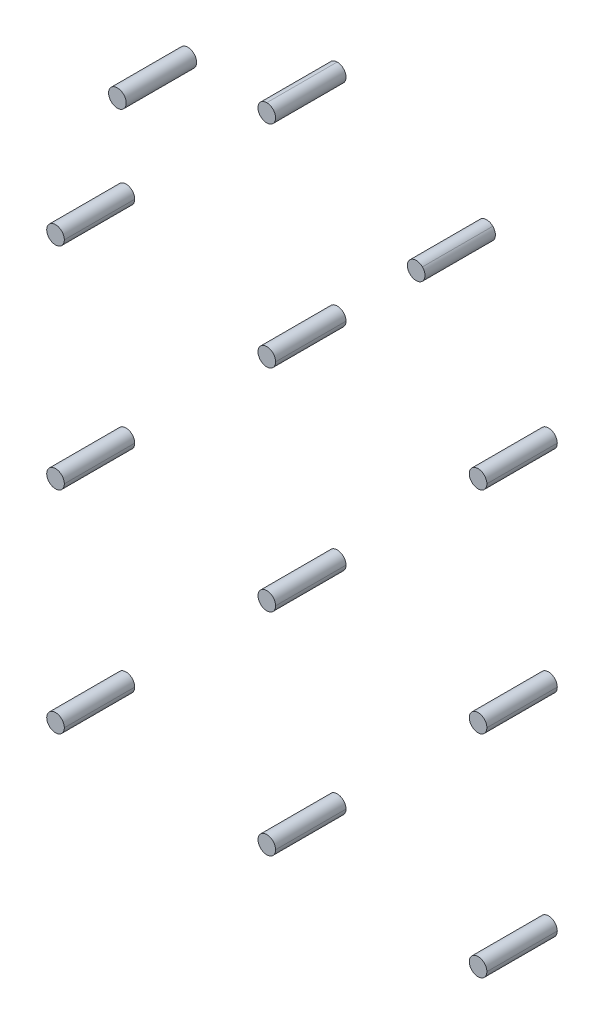
ISO-10303-21;
HEADER;
FILE_DESCRIPTION(('STEP AP214'),'2;1');
FILE_NAME('part.step','',(''),(''),'','','');
FILE_SCHEMA(('AUTOMOTIVE_DESIGN { 1 0 10303 214 1 1 1 1 }'));
ENDSEC;
DATA;
#1=APPLICATION_CONTEXT('core data for automotive mechanical design processes');
#2=APPLICATION_PROTOCOL_DEFINITION('international standard','automotive_design',2000,#1);
#3=PRODUCT_CONTEXT('',#1,'mechanical');
#4=PRODUCT('Part','Part','',(#3));
#5=PRODUCT_RELATED_PRODUCT_CATEGORY('part','',(#4));
#6=PRODUCT_DEFINITION_FORMATION('','',#4);
#7=PRODUCT_DEFINITION_CONTEXT('part definition',#1,'design');
#8=PRODUCT_DEFINITION('design','',#6,#7);
#9=PRODUCT_DEFINITION_SHAPE('','',#8);
#10=(LENGTH_UNIT() NAMED_UNIT(*) SI_UNIT(.MILLI.,.METRE.));
#11=(NAMED_UNIT(*) PLANE_ANGLE_UNIT() SI_UNIT($,.RADIAN.));
#12=(NAMED_UNIT(*) SI_UNIT($,.STERADIAN.) SOLID_ANGLE_UNIT());
#13=UNCERTAINTY_MEASURE_WITH_UNIT(LENGTH_MEASURE(1.E-05),#10,'distance_accuracy_value','');
#14=(GEOMETRIC_REPRESENTATION_CONTEXT(3) GLOBAL_UNCERTAINTY_ASSIGNED_CONTEXT((#13)) GLOBAL_UNIT_ASSIGNED_CONTEXT((#10,
#11,#12)) REPRESENTATION_CONTEXT('',''));
#15=CARTESIAN_POINT('',(0.,0.,0.));
#16=DIRECTION('',(0.,0.,1.));
#17=DIRECTION('',(1.,0.,0.));
#18=AXIS2_PLACEMENT_3D('',#15,#16,#17);
#19=CARTESIAN_POINT('',(0.,0.,1.));
#20=DIRECTION('',(0.,0.,1.));
#21=DIRECTION('',(1.,0.,0.));
#22=AXIS2_PLACEMENT_3D('',#19,#20,#21);
#23=PLANE('',#22);
#24=CARTESIAN_POINT('',(-6.,0.,1.));
#25=DIRECTION('',(0.,0.,1.));
#26=DIRECTION('',(1.,0.,0.));
#27=AXIS2_PLACEMENT_3D('',#24,#25,#26);
#28=CIRCLE('',#27,0.25);
#29=CARTESIAN_POINT('',(-6.25,0.,1.));
#30=VERTEX_POINT('',#29);
#31=CARTESIAN_POINT('',(-5.75,0.,1.));
#32=VERTEX_POINT('',#31);
#33=EDGE_CURVE('P0_E56',#30,#32,#28,.T.);
#34=ORIENTED_EDGE('',*,*,#33,.T.);
#35=CARTESIAN_POINT('',(-6.,0.,1.));
#36=DIRECTION('',(0.,0.,1.));
#37=DIRECTION('',(1.,0.,0.));
#38=AXIS2_PLACEMENT_3D('',#35,#36,#37);
#39=CIRCLE('',#38,0.25);
#40=EDGE_CURVE('P0_E11',#32,#30,#39,.T.);
#41=ORIENTED_EDGE('',*,*,#40,.T.);
#42=EDGE_LOOP('',(#34,#41));
#43=FACE_BOUND('',#42,.T.);
#44=ADVANCED_FACE('P0_F16',(#43),#23,.T.);
#45=CARTESIAN_POINT('',(0.,0.,-1.));
#46=DIRECTION('',(0.,0.,1.));
#47=DIRECTION('',(1.,0.,0.));
#48=AXIS2_PLACEMENT_3D('',#45,#46,#47);
#49=PLANE('',#48);
#50=CARTESIAN_POINT('',(-6.,0.,-1.));
#51=DIRECTION('',(0.,0.,1.));
#52=DIRECTION('',(1.,0.,0.));
#53=AXIS2_PLACEMENT_3D('',#50,#51,#52);
#54=CIRCLE('',#53,0.25);
#55=CARTESIAN_POINT('',(-5.75,0.,-1.));
#56=VERTEX_POINT('',#55);
#57=CARTESIAN_POINT('',(-6.25,0.,-1.));
#58=VERTEX_POINT('',#57);
#59=EDGE_CURVE('P0_E20',#56,#58,#54,.T.);
#60=ORIENTED_EDGE('',*,*,#59,.F.);
#61=CARTESIAN_POINT('',(-6.,0.,-1.));
#62=DIRECTION('',(0.,0.,1.));
#63=DIRECTION('',(1.,0.,0.));
#64=AXIS2_PLACEMENT_3D('',#61,#62,#63);
#65=CIRCLE('',#64,0.25);
#66=EDGE_CURVE('P0_E57',#58,#56,#65,.T.);
#67=ORIENTED_EDGE('',*,*,#66,.F.);
#68=EDGE_LOOP('',(#60,#67));
#69=FACE_BOUND('',#68,.T.);
#70=ADVANCED_FACE('P0_F18',(#69),#49,.F.);
#71=CARTESIAN_POINT('',(-6.,0.,0.));
#72=DIRECTION('',(0.,0.,1.));
#73=DIRECTION('',(-1.,0.,0.));
#74=AXIS2_PLACEMENT_3D('',#71,#72,#73);
#75=CYLINDRICAL_SURFACE('',#74,0.25);
#76=DIRECTION('',(0.,0.,1.));
#77=VECTOR('',#76,1.);
#78=CARTESIAN_POINT('',(-5.75,0.,0.));
#79=LINE('',#78,#77);
#80=EDGE_CURVE('P0_E52',#56,#32,#79,.T.);
#81=ORIENTED_EDGE('',*,*,#80,.F.);
#82=ORIENTED_EDGE('',*,*,#59,.T.);
#83=DIRECTION('',(0.,0.,1.));
#84=VECTOR('',#83,1.);
#85=CARTESIAN_POINT('',(-6.25,0.,0.));
#86=LINE('',#85,#84);
#87=EDGE_CURVE('P0_E50',#58,#30,#86,.T.);
#88=ORIENTED_EDGE('',*,*,#87,.T.);
#89=ORIENTED_EDGE('',*,*,#40,.F.);
#90=EDGE_LOOP('',(#81,#82,#88,#89));
#91=FACE_BOUND('',#90,.T.);
#92=ADVANCED_FACE('P0_F48',(#91),#75,.T.);
#93=CARTESIAN_POINT('',(-6.,0.,0.));
#94=DIRECTION('',(0.,0.,1.));
#95=DIRECTION('',(-1.,0.,0.));
#96=AXIS2_PLACEMENT_3D('',#93,#94,#95);
#97=CYLINDRICAL_SURFACE('',#96,0.25);
#98=ORIENTED_EDGE('',*,*,#87,.F.);
#99=ORIENTED_EDGE('',*,*,#66,.T.);
#100=ORIENTED_EDGE('',*,*,#80,.T.);
#101=ORIENTED_EDGE('',*,*,#33,.F.);
#102=EDGE_LOOP('',(#98,#99,#100,#101));
#103=FACE_BOUND('',#102,.T.);
#104=ADVANCED_FACE('P0_F62',(#103),#97,.T.);
#105=CLOSED_SHELL('',(#44,#70,#92,#104));
#106=MANIFOLD_SOLID_BREP('P0_B1',#105);
#107=CARTESIAN_POINT('',(0.,0.,1.));
#108=DIRECTION('',(0.,0.,1.));
#109=DIRECTION('',(1.,0.,0.));
#110=AXIS2_PLACEMENT_3D('',#107,#108,#109);
#111=PLANE('',#110);
#112=CARTESIAN_POINT('',(-6.,-6.,1.));
#113=DIRECTION('',(0.,0.,1.));
#114=DIRECTION('',(1.,0.,0.));
#115=AXIS2_PLACEMENT_3D('',#112,#113,#114);
#116=CIRCLE('',#115,0.25);
#117=CARTESIAN_POINT('',(-6.25,-6.,1.));
#118=VERTEX_POINT('',#117);
#119=CARTESIAN_POINT('',(-5.75,-6.,1.));
#120=VERTEX_POINT('',#119);
#121=EDGE_CURVE('P1_E59',#118,#120,#116,.T.);
#122=ORIENTED_EDGE('',*,*,#121,.T.);
#123=CARTESIAN_POINT('',(-6.,-6.,1.));
#124=DIRECTION('',(0.,0.,1.));
#125=DIRECTION('',(1.,0.,0.));
#126=AXIS2_PLACEMENT_3D('',#123,#124,#125);
#127=CIRCLE('',#126,0.25);
#128=EDGE_CURVE('P1_E11',#120,#118,#127,.T.);
#129=ORIENTED_EDGE('',*,*,#128,.T.);
#130=EDGE_LOOP('',(#122,#129));
#131=FACE_BOUND('',#130,.T.);
#132=ADVANCED_FACE('P1_F16',(#131),#111,.T.);
#133=CARTESIAN_POINT('',(0.,0.,-1.));
#134=DIRECTION('',(0.,0.,1.));
#135=DIRECTION('',(1.,0.,0.));
#136=AXIS2_PLACEMENT_3D('',#133,#134,#135);
#137=PLANE('',#136);
#138=CARTESIAN_POINT('',(-6.,-6.,-1.));
#139=DIRECTION('',(0.,0.,1.));
#140=DIRECTION('',(1.,0.,0.));
#141=AXIS2_PLACEMENT_3D('',#138,#139,#140);
#142=CIRCLE('',#141,0.25);
#143=CARTESIAN_POINT('',(-5.75,-6.,-1.));
#144=VERTEX_POINT('',#143);
#145=CARTESIAN_POINT('',(-6.25,-6.,-1.));
#146=VERTEX_POINT('',#145);
#147=EDGE_CURVE('P1_E26',#144,#146,#142,.T.);
#148=ORIENTED_EDGE('',*,*,#147,.F.);
#149=CARTESIAN_POINT('',(-6.,-6.,-1.));
#150=DIRECTION('',(0.,0.,1.));
#151=DIRECTION('',(1.,0.,0.));
#152=AXIS2_PLACEMENT_3D('',#149,#150,#151);
#153=CIRCLE('',#152,0.25);
#154=EDGE_CURVE('P1_E60',#146,#144,#153,.T.);
#155=ORIENTED_EDGE('',*,*,#154,.F.);
#156=EDGE_LOOP('',(#148,#155));
#157=FACE_BOUND('',#156,.T.);
#158=ADVANCED_FACE('P1_F61',(#157),#137,.F.);
#159=CARTESIAN_POINT('',(-6.,-6.,0.));
#160=DIRECTION('',(0.,0.,1.));
#161=DIRECTION('',(-1.,0.,0.));
#162=AXIS2_PLACEMENT_3D('',#159,#160,#161);
#163=CYLINDRICAL_SURFACE('',#162,0.25);
#164=DIRECTION('',(0.,0.,1.));
#165=VECTOR('',#164,1.);
#166=CARTESIAN_POINT('',(-5.75,-6.,0.));
#167=LINE('',#166,#165);
#168=EDGE_CURVE('P1_E55',#144,#120,#167,.T.);
#169=ORIENTED_EDGE('',*,*,#168,.F.);
#170=ORIENTED_EDGE('',*,*,#147,.T.);
#171=DIRECTION('',(0.,0.,1.));
#172=VECTOR('',#171,1.);
#173=CARTESIAN_POINT('',(-6.25,-6.,0.));
#174=LINE('',#173,#172);
#175=EDGE_CURVE('P1_E19',#146,#118,#174,.T.);
#176=ORIENTED_EDGE('',*,*,#175,.T.);
#177=ORIENTED_EDGE('',*,*,#128,.F.);
#178=EDGE_LOOP('',(#169,#170,#176,#177));
#179=FACE_BOUND('',#178,.T.);
#180=ADVANCED_FACE('P1_F52',(#179),#163,.T.);
#181=CARTESIAN_POINT('',(-6.,-6.,0.));
#182=DIRECTION('',(0.,0.,1.));
#183=DIRECTION('',(-1.,0.,0.));
#184=AXIS2_PLACEMENT_3D('',#181,#182,#183);
#185=CYLINDRICAL_SURFACE('',#184,0.25);
#186=ORIENTED_EDGE('',*,*,#175,.F.);
#187=ORIENTED_EDGE('',*,*,#154,.T.);
#188=ORIENTED_EDGE('',*,*,#168,.T.);
#189=ORIENTED_EDGE('',*,*,#121,.F.);
#190=EDGE_LOOP('',(#186,#187,#188,#189));
#191=FACE_BOUND('',#190,.T.);
#192=ADVANCED_FACE('P1_F65',(#191),#185,.T.);
#193=CLOSED_SHELL('',(#132,#158,#180,#192));
#194=MANIFOLD_SOLID_BREP('P1_B1',#193);
#195=CARTESIAN_POINT('',(0.,0.,1.));
#196=DIRECTION('',(0.,0.,1.));
#197=DIRECTION('',(1.,0.,0.));
#198=AXIS2_PLACEMENT_3D('',#195,#196,#197);
#199=PLANE('',#198);
#200=CARTESIAN_POINT('',(6.,-6.,1.));
#201=DIRECTION('',(0.,0.,1.));
#202=DIRECTION('',(1.,0.,0.));
#203=AXIS2_PLACEMENT_3D('',#200,#201,#202);
#204=CIRCLE('',#203,0.25);
#205=CARTESIAN_POINT('',(5.75,-6.,1.));
#206=VERTEX_POINT('',#205);
#207=CARTESIAN_POINT('',(6.25,-6.,1.));
#208=VERTEX_POINT('',#207);
#209=EDGE_CURVE('P2_E56',#206,#208,#204,.T.);
#210=ORIENTED_EDGE('',*,*,#209,.T.);
#211=CARTESIAN_POINT('',(6.,-6.,1.));
#212=DIRECTION('',(0.,0.,1.));
#213=DIRECTION('',(1.,0.,0.));
#214=AXIS2_PLACEMENT_3D('',#211,#212,#213);
#215=CIRCLE('',#214,0.25);
#216=EDGE_CURVE('P2_E11',#208,#206,#215,.T.);
#217=ORIENTED_EDGE('',*,*,#216,.T.);
#218=EDGE_LOOP('',(#210,#217));
#219=FACE_BOUND('',#218,.T.);
#220=ADVANCED_FACE('P2_F16',(#219),#199,.T.);
#221=CARTESIAN_POINT('',(0.,0.,-1.));
#222=DIRECTION('',(0.,0.,1.));
#223=DIRECTION('',(1.,0.,0.));
#224=AXIS2_PLACEMENT_3D('',#221,#222,#223);
#225=PLANE('',#224);
#226=CARTESIAN_POINT('',(6.,-6.,-1.));
#227=DIRECTION('',(0.,0.,1.));
#228=DIRECTION('',(1.,0.,0.));
#229=AXIS2_PLACEMENT_3D('',#226,#227,#228);
#230=CIRCLE('',#229,0.25);
#231=CARTESIAN_POINT('',(6.25,-6.,-1.));
#232=VERTEX_POINT('',#231);
#233=CARTESIAN_POINT('',(5.75,-6.,-1.));
#234=VERTEX_POINT('',#233);
#235=EDGE_CURVE('P2_E26',#232,#234,#230,.T.);
#236=ORIENTED_EDGE('',*,*,#235,.F.);
#237=CARTESIAN_POINT('',(6.,-6.,-1.));
#238=DIRECTION('',(0.,0.,1.));
#239=DIRECTION('',(1.,0.,0.));
#240=AXIS2_PLACEMENT_3D('',#237,#238,#239);
#241=CIRCLE('',#240,0.25);
#242=EDGE_CURVE('P2_E58',#234,#232,#241,.T.);
#243=ORIENTED_EDGE('',*,*,#242,.F.);
#244=EDGE_LOOP('',(#236,#243));
#245=FACE_BOUND('',#244,.T.);
#246=ADVANCED_FACE('P2_F59',(#245),#225,.F.);
#247=CARTESIAN_POINT('',(6.,-6.,0.));
#248=DIRECTION('',(0.,0.,1.));
#249=DIRECTION('',(-1.,0.,0.));
#250=AXIS2_PLACEMENT_3D('',#247,#248,#249);
#251=CYLINDRICAL_SURFACE('',#250,0.25);
#252=DIRECTION('',(0.,0.,1.));
#253=VECTOR('',#252,1.);
#254=CARTESIAN_POINT('',(6.25,-6.,0.));
#255=LINE('',#254,#253);
#256=EDGE_CURVE('P2_E20',#232,#208,#255,.T.);
#257=ORIENTED_EDGE('',*,*,#256,.F.);
#258=ORIENTED_EDGE('',*,*,#235,.T.);
#259=DIRECTION('',(0.,0.,1.));
#260=VECTOR('',#259,1.);
#261=CARTESIAN_POINT('',(5.75,-6.,0.));
#262=LINE('',#261,#260);
#263=EDGE_CURVE('P2_E52',#234,#206,#262,.T.);
#264=ORIENTED_EDGE('',*,*,#263,.T.);
#265=ORIENTED_EDGE('',*,*,#216,.F.);
#266=EDGE_LOOP('',(#257,#258,#264,#265));
#267=FACE_BOUND('',#266,.T.);
#268=ADVANCED_FACE('P2_F18',(#267),#251,.T.);
#269=CARTESIAN_POINT('',(6.,-6.,0.));
#270=DIRECTION('',(0.,0.,1.));
#271=DIRECTION('',(-1.,0.,0.));
#272=AXIS2_PLACEMENT_3D('',#269,#270,#271);
#273=CYLINDRICAL_SURFACE('',#272,0.25);
#274=ORIENTED_EDGE('',*,*,#263,.F.);
#275=ORIENTED_EDGE('',*,*,#242,.T.);
#276=ORIENTED_EDGE('',*,*,#256,.T.);
#277=ORIENTED_EDGE('',*,*,#209,.F.);
#278=EDGE_LOOP('',(#274,#275,#276,#277));
#279=FACE_BOUND('',#278,.T.);
#280=ADVANCED_FACE('P2_F64',(#279),#273,.T.);
#281=CLOSED_SHELL('',(#220,#246,#268,#280));
#282=MANIFOLD_SOLID_BREP('P2_B1',#281);
#283=CARTESIAN_POINT('',(0.,0.,1.));
#284=DIRECTION('',(0.,0.,1.));
#285=DIRECTION('',(1.,0.,0.));
#286=AXIS2_PLACEMENT_3D('',#283,#284,#285);
#287=PLANE('',#286);
#288=CARTESIAN_POINT('',(6.,-12.,1.));
#289=DIRECTION('',(0.,0.,1.));
#290=DIRECTION('',(1.,0.,0.));
#291=AXIS2_PLACEMENT_3D('',#288,#289,#290);
#292=CIRCLE('',#291,0.25);
#293=CARTESIAN_POINT('',(5.75,-12.,1.));
#294=VERTEX_POINT('',#293);
#295=CARTESIAN_POINT('',(6.25,-12.,1.));
#296=VERTEX_POINT('',#295);
#297=EDGE_CURVE('P3_E50',#294,#296,#292,.T.);
#298=ORIENTED_EDGE('',*,*,#297,.T.);
#299=CARTESIAN_POINT('',(6.,-12.,1.));
#300=DIRECTION('',(0.,0.,1.));
#301=DIRECTION('',(1.,0.,0.));
#302=AXIS2_PLACEMENT_3D('',#299,#300,#301);
#303=CIRCLE('',#302,0.25);
#304=EDGE_CURVE('P3_E11',#296,#294,#303,.T.);
#305=ORIENTED_EDGE('',*,*,#304,.T.);
#306=EDGE_LOOP('',(#298,#305));
#307=FACE_BOUND('',#306,.T.);
#308=ADVANCED_FACE('P3_F16',(#307),#287,.T.);
#309=CARTESIAN_POINT('',(0.,0.,-1.));
#310=DIRECTION('',(0.,0.,1.));
#311=DIRECTION('',(1.,0.,0.));
#312=AXIS2_PLACEMENT_3D('',#309,#310,#311);
#313=PLANE('',#312);
#314=CARTESIAN_POINT('',(6.,-12.,-1.));
#315=DIRECTION('',(0.,0.,1.));
#316=DIRECTION('',(1.,0.,0.));
#317=AXIS2_PLACEMENT_3D('',#314,#315,#316);
#318=CIRCLE('',#317,0.25);
#319=CARTESIAN_POINT('',(6.25,-12.,-1.));
#320=VERTEX_POINT('',#319);
#321=CARTESIAN_POINT('',(5.75,-12.,-1.));
#322=VERTEX_POINT('',#321);
#323=EDGE_CURVE('P3_E26',#320,#322,#318,.T.);
#324=ORIENTED_EDGE('',*,*,#323,.F.);
#325=CARTESIAN_POINT('',(6.,-12.,-1.));
#326=DIRECTION('',(0.,0.,1.));
#327=DIRECTION('',(1.,0.,0.));
#328=AXIS2_PLACEMENT_3D('',#325,#326,#327);
#329=CIRCLE('',#328,0.25);
#330=EDGE_CURVE('P3_E61',#322,#320,#329,.T.);
#331=ORIENTED_EDGE('',*,*,#330,.F.);
#332=EDGE_LOOP('',(#324,#331));
#333=FACE_BOUND('',#332,.T.);
#334=ADVANCED_FACE('P3_F107',(#333),#313,.F.);
#335=CARTESIAN_POINT('',(6.,-12.,0.));
#336=DIRECTION('',(0.,0.,1.));
#337=DIRECTION('',(-1.,0.,0.));
#338=AXIS2_PLACEMENT_3D('',#335,#336,#337);
#339=CYLINDRICAL_SURFACE('',#338,0.25);
#340=DIRECTION('',(0.,0.,1.));
#341=VECTOR('',#340,1.);
#342=CARTESIAN_POINT('',(6.25,-12.,0.));
#343=LINE('',#342,#341);
#344=EDGE_CURVE('P3_E57',#320,#296,#343,.T.);
#345=ORIENTED_EDGE('',*,*,#344,.F.);
#346=ORIENTED_EDGE('',*,*,#323,.T.);
#347=DIRECTION('',(0.,0.,1.));
#348=VECTOR('',#347,1.);
#349=CARTESIAN_POINT('',(5.75,-12.,0.));
#350=LINE('',#349,#348);
#351=EDGE_CURVE('P3_E56',#322,#294,#350,.T.);
#352=ORIENTED_EDGE('',*,*,#351,.T.);
#353=ORIENTED_EDGE('',*,*,#304,.F.);
#354=EDGE_LOOP('',(#345,#346,#352,#353));
#355=FACE_BOUND('',#354,.T.);
#356=ADVANCED_FACE('P3_F18',(#355),#339,.T.);
#357=CARTESIAN_POINT('',(6.,-12.,0.));
#358=DIRECTION('',(0.,0.,1.));
#359=DIRECTION('',(-1.,0.,0.));
#360=AXIS2_PLACEMENT_3D('',#357,#358,#359);
#361=CYLINDRICAL_SURFACE('',#360,0.25);
#362=ORIENTED_EDGE('',*,*,#351,.F.);
#363=ORIENTED_EDGE('',*,*,#330,.T.);
#364=ORIENTED_EDGE('',*,*,#344,.T.);
#365=ORIENTED_EDGE('',*,*,#297,.F.);
#366=EDGE_LOOP('',(#362,#363,#364,#365));
#367=FACE_BOUND('',#366,.T.);
#368=ADVANCED_FACE('P3_F54',(#367),#361,.T.);
#369=CLOSED_SHELL('',(#308,#334,#356,#368));
#370=MANIFOLD_SOLID_BREP('P3_B1',#369);
#371=CARTESIAN_POINT('',(0.,0.,1.));
#372=DIRECTION('',(0.,0.,1.));
#373=DIRECTION('',(1.,0.,0.));
#374=AXIS2_PLACEMENT_3D('',#371,#372,#373);
#375=PLANE('',#374);
#376=CARTESIAN_POINT('',(-4.24264068712,4.24264068712,1.));
#377=DIRECTION('',(0.,0.,1.));
#378=DIRECTION('',(1.,0.,0.));
#379=AXIS2_PLACEMENT_3D('',#376,#377,#378);
#380=CIRCLE('',#379,0.25);
#381=CARTESIAN_POINT('',(-4.41941738242,4.41941738242,1.));
#382=VERTEX_POINT('',#381);
#383=CARTESIAN_POINT('',(-4.06586399182,4.06586399182,1.));
#384=VERTEX_POINT('',#383);
#385=EDGE_CURVE('P4_E48',#382,#384,#380,.T.);
#386=ORIENTED_EDGE('',*,*,#385,.T.);
#387=CARTESIAN_POINT('',(-4.24264068712,4.24264068712,1.));
#388=DIRECTION('',(0.,0.,1.));
#389=DIRECTION('',(1.,0.,0.));
#390=AXIS2_PLACEMENT_3D('',#387,#388,#389);
#391=CIRCLE('',#390,0.25);
#392=EDGE_CURVE('P4_E11',#384,#382,#391,.T.);
#393=ORIENTED_EDGE('',*,*,#392,.T.);
#394=EDGE_LOOP('',(#386,#393));
#395=FACE_BOUND('',#394,.T.);
#396=ADVANCED_FACE('P4_F16',(#395),#375,.T.);
#397=CARTESIAN_POINT('',(0.,0.,-1.));
#398=DIRECTION('',(0.,0.,1.));
#399=DIRECTION('',(1.,0.,0.));
#400=AXIS2_PLACEMENT_3D('',#397,#398,#399);
#401=PLANE('',#400);
#402=CARTESIAN_POINT('',(-4.24264068712,4.24264068712,-1.));
#403=DIRECTION('',(0.,0.,1.));
#404=DIRECTION('',(1.,0.,0.));
#405=AXIS2_PLACEMENT_3D('',#402,#403,#404);
#406=CIRCLE('',#405,0.25);
#407=CARTESIAN_POINT('',(-4.06586399182,4.06586399182,-1.));
#408=VERTEX_POINT('',#407);
#409=CARTESIAN_POINT('',(-4.41941738242,4.41941738242,-1.));
#410=VERTEX_POINT('',#409);
#411=EDGE_CURVE('P4_E26',#408,#410,#406,.T.);
#412=ORIENTED_EDGE('',*,*,#411,.F.);
#413=CARTESIAN_POINT('',(-4.24264068712,4.24264068712,-1.));
#414=DIRECTION('',(0.,0.,1.));
#415=DIRECTION('',(1.,0.,0.));
#416=AXIS2_PLACEMENT_3D('',#413,#414,#415);
#417=CIRCLE('',#416,0.25);
#418=EDGE_CURVE('P4_E60',#410,#408,#417,.T.);
#419=ORIENTED_EDGE('',*,*,#418,.F.);
#420=EDGE_LOOP('',(#412,#419));
#421=FACE_BOUND('',#420,.T.);
#422=ADVANCED_FACE('P4_F104',(#421),#401,.F.);
#423=CARTESIAN_POINT('',(-4.24264068712,4.24264068712,0.));
#424=DIRECTION('',(0.,0.,1.));
#425=DIRECTION('',(-0.707106781186548,0.707106781186548,0.));
#426=AXIS2_PLACEMENT_3D('',#423,#424,#425);
#427=CYLINDRICAL_SURFACE('',#426,0.25);
#428=DIRECTION('',(0.,0.,1.));
#429=VECTOR('',#428,1.);
#430=CARTESIAN_POINT('',(-4.06586399182,4.06586399182,0.));
#431=LINE('',#430,#429);
#432=EDGE_CURVE('P4_E55',#408,#384,#431,.T.);
#433=ORIENTED_EDGE('',*,*,#432,.F.);
#434=ORIENTED_EDGE('',*,*,#411,.T.);
#435=DIRECTION('',(0.,0.,1.));
#436=VECTOR('',#435,1.);
#437=CARTESIAN_POINT('',(-4.41941738242,4.41941738242,0.));
#438=LINE('',#437,#436);
#439=EDGE_CURVE('P4_E54',#410,#382,#438,.T.);
#440=ORIENTED_EDGE('',*,*,#439,.T.);
#441=ORIENTED_EDGE('',*,*,#392,.F.);
#442=EDGE_LOOP('',(#433,#434,#440,#441));
#443=FACE_BOUND('',#442,.T.);
#444=ADVANCED_FACE('P4_F18',(#443),#427,.T.);
#445=CARTESIAN_POINT('',(-4.24264068712,4.24264068712,0.));
#446=DIRECTION('',(0.,0.,1.));
#447=DIRECTION('',(-0.707106781186548,0.707106781186548,0.));
#448=AXIS2_PLACEMENT_3D('',#445,#446,#447);
#449=CYLINDRICAL_SURFACE('',#448,0.25);
#450=ORIENTED_EDGE('',*,*,#439,.F.);
#451=ORIENTED_EDGE('',*,*,#418,.T.);
#452=ORIENTED_EDGE('',*,*,#432,.T.);
#453=ORIENTED_EDGE('',*,*,#385,.F.);
#454=EDGE_LOOP('',(#450,#451,#452,#453));
#455=FACE_BOUND('',#454,.T.);
#456=ADVANCED_FACE('P4_F52',(#455),#449,.T.);
#457=CLOSED_SHELL('',(#396,#422,#444,#456));
#458=MANIFOLD_SOLID_BREP('P4_B1',#457);
#459=CARTESIAN_POINT('',(0.,0.,1.));
#460=DIRECTION('',(0.,0.,1.));
#461=DIRECTION('',(1.,0.,0.));
#462=AXIS2_PLACEMENT_3D('',#459,#460,#461);
#463=PLANE('',#462);
#464=CARTESIAN_POINT('',(0.,6.,1.));
#465=DIRECTION('',(0.,0.,1.));
#466=DIRECTION('',(1.,0.,0.));
#467=AXIS2_PLACEMENT_3D('',#464,#465,#466);
#468=CIRCLE('',#467,0.25);
#469=CARTESIAN_POINT('',(0.,6.25,1.));
#470=VERTEX_POINT('',#469);
#471=CARTESIAN_POINT('',(0.,5.75,1.));
#472=VERTEX_POINT('',#471);
#473=EDGE_CURVE('P5_E57',#470,#472,#468,.T.);
#474=ORIENTED_EDGE('',*,*,#473,.T.);
#475=CARTESIAN_POINT('',(0.,6.,1.));
#476=DIRECTION('',(0.,0.,1.));
#477=DIRECTION('',(1.,0.,0.));
#478=AXIS2_PLACEMENT_3D('',#475,#476,#477);
#479=CIRCLE('',#478,0.25);
#480=EDGE_CURVE('P5_E11',#472,#470,#479,.T.);
#481=ORIENTED_EDGE('',*,*,#480,.T.);
#482=EDGE_LOOP('',(#474,#481));
#483=FACE_BOUND('',#482,.T.);
#484=ADVANCED_FACE('P5_F16',(#483),#463,.T.);
#485=CARTESIAN_POINT('',(0.,0.,-1.));
#486=DIRECTION('',(0.,0.,1.));
#487=DIRECTION('',(1.,0.,0.));
#488=AXIS2_PLACEMENT_3D('',#485,#486,#487);
#489=PLANE('',#488);
#490=CARTESIAN_POINT('',(0.,6.,-1.));
#491=DIRECTION('',(0.,0.,1.));
#492=DIRECTION('',(1.,0.,0.));
#493=AXIS2_PLACEMENT_3D('',#490,#491,#492);
#494=CIRCLE('',#493,0.25);
#495=CARTESIAN_POINT('',(0.,5.75,-1.));
#496=VERTEX_POINT('',#495);
#497=CARTESIAN_POINT('',(0.,6.25,-1.));
#498=VERTEX_POINT('',#497);
#499=EDGE_CURVE('P5_E26',#496,#498,#494,.T.);
#500=ORIENTED_EDGE('',*,*,#499,.F.);
#501=CARTESIAN_POINT('',(0.,6.,-1.));
#502=DIRECTION('',(0.,0.,1.));
#503=DIRECTION('',(1.,0.,0.));
#504=AXIS2_PLACEMENT_3D('',#501,#502,#503);
#505=CIRCLE('',#504,0.25);
#506=EDGE_CURVE('P5_E20',#498,#496,#505,.T.);
#507=ORIENTED_EDGE('',*,*,#506,.F.);
#508=EDGE_LOOP('',(#500,#507));
#509=FACE_BOUND('',#508,.T.);
#510=ADVANCED_FACE('P5_F59',(#509),#489,.F.);
#511=CARTESIAN_POINT('',(0.,6.,0.));
#512=DIRECTION('',(0.,0.,1.));
#513=DIRECTION('',(0.,1.,0.));
#514=AXIS2_PLACEMENT_3D('',#511,#512,#513);
#515=CYLINDRICAL_SURFACE('',#514,0.25);
#516=DIRECTION('',(0.,0.,1.));
#517=VECTOR('',#516,1.);
#518=CARTESIAN_POINT('',(0.,5.75,0.));
#519=LINE('',#518,#517);
#520=EDGE_CURVE('P5_E54',#496,#472,#519,.T.);
#521=ORIENTED_EDGE('',*,*,#520,.F.);
#522=ORIENTED_EDGE('',*,*,#499,.T.);
#523=DIRECTION('',(0.,0.,1.));
#524=VECTOR('',#523,1.);
#525=CARTESIAN_POINT('',(0.,6.25,0.));
#526=LINE('',#525,#524);
#527=EDGE_CURVE('P5_E52',#498,#470,#526,.T.);
#528=ORIENTED_EDGE('',*,*,#527,.T.);
#529=ORIENTED_EDGE('',*,*,#480,.F.);
#530=EDGE_LOOP('',(#521,#522,#528,#529));
#531=FACE_BOUND('',#530,.T.);
#532=ADVANCED_FACE('P5_F18',(#531),#515,.T.);
#533=CARTESIAN_POINT('',(0.,6.,0.));
#534=DIRECTION('',(0.,0.,1.));
#535=DIRECTION('',(0.,1.,0.));
#536=AXIS2_PLACEMENT_3D('',#533,#534,#535);
#537=CYLINDRICAL_SURFACE('',#536,0.25);
#538=ORIENTED_EDGE('',*,*,#527,.F.);
#539=ORIENTED_EDGE('',*,*,#506,.T.);
#540=ORIENTED_EDGE('',*,*,#520,.T.);
#541=ORIENTED_EDGE('',*,*,#473,.F.);
#542=EDGE_LOOP('',(#538,#539,#540,#541));
#543=FACE_BOUND('',#542,.T.);
#544=ADVANCED_FACE('P5_F63',(#543),#537,.T.);
#545=CLOSED_SHELL('',(#484,#510,#532,#544));
#546=MANIFOLD_SOLID_BREP('P5_B1',#545);
#547=CARTESIAN_POINT('',(0.,0.,1.));
#548=DIRECTION('',(0.,0.,1.));
#549=DIRECTION('',(1.,0.,0.));
#550=AXIS2_PLACEMENT_3D('',#547,#548,#549);
#551=PLANE('',#550);
#552=CARTESIAN_POINT('',(4.24264068712,4.24264068712,1.));
#553=DIRECTION('',(0.,0.,1.));
#554=DIRECTION('',(1.,0.,0.));
#555=AXIS2_PLACEMENT_3D('',#552,#553,#554);
#556=CIRCLE('',#555,0.25);
#557=CARTESIAN_POINT('',(4.41941738242,4.41941738242,1.));
#558=VERTEX_POINT('',#557);
#559=CARTESIAN_POINT('',(4.06586399182,4.06586399182,1.));
#560=VERTEX_POINT('',#559);
#561=EDGE_CURVE('P6_E58',#558,#560,#556,.T.);
#562=ORIENTED_EDGE('',*,*,#561,.T.);
#563=CARTESIAN_POINT('',(4.24264068712,4.24264068712,1.));
#564=DIRECTION('',(0.,0.,1.));
#565=DIRECTION('',(1.,0.,0.));
#566=AXIS2_PLACEMENT_3D('',#563,#564,#565);
#567=CIRCLE('',#566,0.25);
#568=EDGE_CURVE('P6_E11',#560,#558,#567,.T.);
#569=ORIENTED_EDGE('',*,*,#568,.T.);
#570=EDGE_LOOP('',(#562,#569));
#571=FACE_BOUND('',#570,.T.);
#572=ADVANCED_FACE('P6_F16',(#571),#551,.T.);
#573=CARTESIAN_POINT('',(0.,0.,-1.));
#574=DIRECTION('',(0.,0.,1.));
#575=DIRECTION('',(1.,0.,0.));
#576=AXIS2_PLACEMENT_3D('',#573,#574,#575);
#577=PLANE('',#576);
#578=CARTESIAN_POINT('',(4.24264068712,4.24264068712,-1.));
#579=DIRECTION('',(0.,0.,1.));
#580=DIRECTION('',(1.,0.,0.));
#581=AXIS2_PLACEMENT_3D('',#578,#579,#580);
#582=CIRCLE('',#581,0.25);
#583=CARTESIAN_POINT('',(4.06586399182,4.06586399182,-1.));
#584=VERTEX_POINT('',#583);
#585=CARTESIAN_POINT('',(4.41941738242,4.41941738242,-1.));
#586=VERTEX_POINT('',#585);
#587=EDGE_CURVE('P6_E26',#584,#586,#582,.T.);
#588=ORIENTED_EDGE('',*,*,#587,.F.);
#589=CARTESIAN_POINT('',(4.24264068712,4.24264068712,-1.));
#590=DIRECTION('',(0.,0.,1.));
#591=DIRECTION('',(1.,0.,0.));
#592=AXIS2_PLACEMENT_3D('',#589,#590,#591);
#593=CIRCLE('',#592,0.25);
#594=EDGE_CURVE('P6_E60',#586,#584,#593,.T.);
#595=ORIENTED_EDGE('',*,*,#594,.F.);
#596=EDGE_LOOP('',(#588,#595));
#597=FACE_BOUND('',#596,.T.);
#598=ADVANCED_FACE('P6_F18',(#597),#577,.F.);
#599=CARTESIAN_POINT('',(4.24264068712,4.24264068712,0.));
#600=DIRECTION('',(0.,0.,1.));
#601=DIRECTION('',(0.707106781186548,0.707106781186548,0.));
#602=AXIS2_PLACEMENT_3D('',#599,#600,#601);
#603=CYLINDRICAL_SURFACE('',#602,0.25);
#604=DIRECTION('',(0.,0.,1.));
#605=VECTOR('',#604,1.);
#606=CARTESIAN_POINT('',(4.06586399182,4.06586399182,0.));
#607=LINE('',#606,#605);
#608=EDGE_CURVE('P6_E55',#584,#560,#607,.T.);
#609=ORIENTED_EDGE('',*,*,#608,.F.);
#610=ORIENTED_EDGE('',*,*,#587,.T.);
#611=DIRECTION('',(0.,0.,1.));
#612=VECTOR('',#611,1.);
#613=CARTESIAN_POINT('',(4.41941738242,4.41941738242,0.));
#614=LINE('',#613,#612);
#615=EDGE_CURVE('P6_E20',#586,#558,#614,.T.);
#616=ORIENTED_EDGE('',*,*,#615,.T.);
#617=ORIENTED_EDGE('',*,*,#568,.F.);
#618=EDGE_LOOP('',(#609,#610,#616,#617));
#619=FACE_BOUND('',#618,.T.);
#620=ADVANCED_FACE('P6_F52',(#619),#603,.T.);
#621=CARTESIAN_POINT('',(4.24264068712,4.24264068712,0.));
#622=DIRECTION('',(0.,0.,1.));
#623=DIRECTION('',(0.707106781186548,0.707106781186548,0.));
#624=AXIS2_PLACEMENT_3D('',#621,#622,#623);
#625=CYLINDRICAL_SURFACE('',#624,0.25);
#626=ORIENTED_EDGE('',*,*,#615,.F.);
#627=ORIENTED_EDGE('',*,*,#594,.T.);
#628=ORIENTED_EDGE('',*,*,#608,.T.);
#629=ORIENTED_EDGE('',*,*,#561,.F.);
#630=EDGE_LOOP('',(#626,#627,#628,#629));
#631=FACE_BOUND('',#630,.T.);
#632=ADVANCED_FACE('P6_F65',(#631),#625,.T.);
#633=CLOSED_SHELL('',(#572,#598,#620,#632));
#634=MANIFOLD_SOLID_BREP('P6_B1',#633);
#635=CARTESIAN_POINT('',(0.,0.,1.));
#636=DIRECTION('',(0.,0.,1.));
#637=DIRECTION('',(1.,0.,0.));
#638=AXIS2_PLACEMENT_3D('',#635,#636,#637);
#639=PLANE('',#638);
#640=CARTESIAN_POINT('',(6.,0.,1.));
#641=DIRECTION('',(0.,0.,1.));
#642=DIRECTION('',(1.,0.,0.));
#643=AXIS2_PLACEMENT_3D('',#640,#641,#642);
#644=CIRCLE('',#643,0.25);
#645=CARTESIAN_POINT('',(5.75,0.,1.));
#646=VERTEX_POINT('',#645);
#647=CARTESIAN_POINT('',(6.25,0.,1.));
#648=VERTEX_POINT('',#647);
#649=EDGE_CURVE('P7_E52',#646,#648,#644,.T.);
#650=ORIENTED_EDGE('',*,*,#649,.T.);
#651=CARTESIAN_POINT('',(6.,0.,1.));
#652=DIRECTION('',(0.,0.,1.));
#653=DIRECTION('',(1.,0.,0.));
#654=AXIS2_PLACEMENT_3D('',#651,#652,#653);
#655=CIRCLE('',#654,0.25);
#656=EDGE_CURVE('P7_E11',#648,#646,#655,.T.);
#657=ORIENTED_EDGE('',*,*,#656,.T.);
#658=EDGE_LOOP('',(#650,#657));
#659=FACE_BOUND('',#658,.T.);
#660=ADVANCED_FACE('P7_F16',(#659),#639,.T.);
#661=CARTESIAN_POINT('',(0.,0.,-1.));
#662=DIRECTION('',(0.,0.,1.));
#663=DIRECTION('',(1.,0.,0.));
#664=AXIS2_PLACEMENT_3D('',#661,#662,#663);
#665=PLANE('',#664);
#666=CARTESIAN_POINT('',(6.,0.,-1.));
#667=DIRECTION('',(0.,0.,1.));
#668=DIRECTION('',(1.,0.,0.));
#669=AXIS2_PLACEMENT_3D('',#666,#667,#668);
#670=CIRCLE('',#669,0.25);
#671=CARTESIAN_POINT('',(6.25,0.,-1.));
#672=VERTEX_POINT('',#671);
#673=CARTESIAN_POINT('',(5.75,0.,-1.));
#674=VERTEX_POINT('',#673);
#675=EDGE_CURVE('P7_E26',#672,#674,#670,.T.);
#676=ORIENTED_EDGE('',*,*,#675,.F.);
#677=CARTESIAN_POINT('',(6.,0.,-1.));
#678=DIRECTION('',(0.,0.,1.));
#679=DIRECTION('',(1.,0.,0.));
#680=AXIS2_PLACEMENT_3D('',#677,#678,#679);
#681=CIRCLE('',#680,0.25);
#682=EDGE_CURVE('P7_E19',#674,#672,#681,.T.);
#683=ORIENTED_EDGE('',*,*,#682,.F.);
#684=EDGE_LOOP('',(#676,#683));
#685=FACE_BOUND('',#684,.T.);
#686=ADVANCED_FACE('P7_F96',(#685),#665,.F.);
#687=CARTESIAN_POINT('',(6.,0.,0.));
#688=DIRECTION('',(0.,0.,1.));
#689=DIRECTION('',(-1.,0.,0.));
#690=AXIS2_PLACEMENT_3D('',#687,#688,#689);
#691=CYLINDRICAL_SURFACE('',#690,0.25);
#692=DIRECTION('',(0.,0.,1.));
#693=VECTOR('',#692,1.);
#694=CARTESIAN_POINT('',(6.25,0.,0.));
#695=LINE('',#694,#693);
#696=EDGE_CURVE('P7_E59',#672,#648,#695,.T.);
#697=ORIENTED_EDGE('',*,*,#696,.F.);
#698=ORIENTED_EDGE('',*,*,#675,.T.);
#699=DIRECTION('',(0.,0.,1.));
#700=VECTOR('',#699,1.);
#701=CARTESIAN_POINT('',(5.75,0.,0.));
#702=LINE('',#701,#700);
#703=EDGE_CURVE('P7_E58',#674,#646,#702,.T.);
#704=ORIENTED_EDGE('',*,*,#703,.T.);
#705=ORIENTED_EDGE('',*,*,#656,.F.);
#706=EDGE_LOOP('',(#697,#698,#704,#705));
#707=FACE_BOUND('',#706,.T.);
#708=ADVANCED_FACE('P7_F61',(#707),#691,.T.);
#709=CARTESIAN_POINT('',(6.,0.,0.));
#710=DIRECTION('',(0.,0.,1.));
#711=DIRECTION('',(-1.,0.,0.));
#712=AXIS2_PLACEMENT_3D('',#709,#710,#711);
#713=CYLINDRICAL_SURFACE('',#712,0.25);
#714=ORIENTED_EDGE('',*,*,#703,.F.);
#715=ORIENTED_EDGE('',*,*,#682,.T.);
#716=ORIENTED_EDGE('',*,*,#696,.T.);
#717=ORIENTED_EDGE('',*,*,#649,.F.);
#718=EDGE_LOOP('',(#714,#715,#716,#717));
#719=FACE_BOUND('',#718,.T.);
#720=ADVANCED_FACE('P7_F56',(#719),#713,.T.);
#721=CLOSED_SHELL('',(#660,#686,#708,#720));
#722=MANIFOLD_SOLID_BREP('P7_B1',#721);
#723=CARTESIAN_POINT('',(0.,0.,1.));
#724=DIRECTION('',(0.,0.,1.));
#725=DIRECTION('',(1.,0.,0.));
#726=AXIS2_PLACEMENT_3D('',#723,#724,#725);
#727=PLANE('',#726);
#728=CARTESIAN_POINT('',(0.,0.,1.));
#729=DIRECTION('',(0.,0.,1.));
#730=DIRECTION('',(1.,0.,0.));
#731=AXIS2_PLACEMENT_3D('',#728,#729,#730);
#732=CIRCLE('',#731,0.25);
#733=CARTESIAN_POINT('',(0.25,0.,1.));
#734=VERTEX_POINT('',#733);
#735=CARTESIAN_POINT('',(-0.25,0.,1.));
#736=VERTEX_POINT('',#735);
#737=EDGE_CURVE('P8_E52',#734,#736,#732,.T.);
#738=ORIENTED_EDGE('',*,*,#737,.T.);
#739=CARTESIAN_POINT('',(0.,0.,1.));
#740=DIRECTION('',(0.,0.,1.));
#741=DIRECTION('',(1.,0.,0.));
#742=AXIS2_PLACEMENT_3D('',#739,#740,#741);
#743=CIRCLE('',#742,0.25);
#744=EDGE_CURVE('P8_E11',#736,#734,#743,.T.);
#745=ORIENTED_EDGE('',*,*,#744,.T.);
#746=EDGE_LOOP('',(#738,#745));
#747=FACE_BOUND('',#746,.T.);
#748=ADVANCED_FACE('P8_F16',(#747),#727,.T.);
#749=CARTESIAN_POINT('',(0.,0.,-1.));
#750=DIRECTION('',(0.,0.,1.));
#751=DIRECTION('',(1.,0.,0.));
#752=AXIS2_PLACEMENT_3D('',#749,#750,#751);
#753=PLANE('',#752);
#754=CARTESIAN_POINT('',(0.,0.,-1.));
#755=DIRECTION('',(0.,0.,1.));
#756=DIRECTION('',(1.,0.,0.));
#757=AXIS2_PLACEMENT_3D('',#754,#755,#756);
#758=CIRCLE('',#757,0.25);
#759=CARTESIAN_POINT('',(-0.25,0.,-1.));
#760=VERTEX_POINT('',#759);
#761=CARTESIAN_POINT('',(0.25,0.,-1.));
#762=VERTEX_POINT('',#761);
#763=EDGE_CURVE('P8_E27',#760,#762,#758,.T.);
#764=ORIENTED_EDGE('',*,*,#763,.F.);
#765=CARTESIAN_POINT('',(0.,0.,-1.));
#766=DIRECTION('',(0.,0.,1.));
#767=DIRECTION('',(1.,0.,0.));
#768=AXIS2_PLACEMENT_3D('',#765,#766,#767);
#769=CIRCLE('',#768,0.25);
#770=EDGE_CURVE('P8_E20',#762,#760,#769,.T.);
#771=ORIENTED_EDGE('',*,*,#770,.F.);
#772=EDGE_LOOP('',(#764,#771));
#773=FACE_BOUND('',#772,.T.);
#774=ADVANCED_FACE('P8_F89',(#773),#753,.F.);
#775=CARTESIAN_POINT('',(0.,0.,0.));
#776=DIRECTION('',(0.,0.,1.));
#777=DIRECTION('',(1.,0.,0.));
#778=AXIS2_PLACEMENT_3D('',#775,#776,#777);
#779=CYLINDRICAL_SURFACE('',#778,0.25);
#780=DIRECTION('',(0.,0.,1.));
#781=VECTOR('',#780,1.);
#782=CARTESIAN_POINT('',(-0.25,0.,0.));
#783=LINE('',#782,#781);
#784=EDGE_CURVE('P8_E59',#760,#736,#783,.T.);
#785=ORIENTED_EDGE('',*,*,#784,.F.);
#786=ORIENTED_EDGE('',*,*,#763,.T.);
#787=DIRECTION('',(0.,0.,1.));
#788=VECTOR('',#787,1.);
#789=CARTESIAN_POINT('',(0.25,0.,0.));
#790=LINE('',#789,#788);
#791=EDGE_CURVE('P8_E58',#762,#734,#790,.T.);
#792=ORIENTED_EDGE('',*,*,#791,.T.);
#793=ORIENTED_EDGE('',*,*,#744,.F.);
#794=EDGE_LOOP('',(#785,#786,#792,#793));
#795=FACE_BOUND('',#794,.T.);
#796=ADVANCED_FACE('P8_F18',(#795),#779,.T.);
#797=CARTESIAN_POINT('',(0.,0.,0.));
#798=DIRECTION('',(0.,0.,1.));
#799=DIRECTION('',(1.,0.,0.));
#800=AXIS2_PLACEMENT_3D('',#797,#798,#799);
#801=CYLINDRICAL_SURFACE('',#800,0.25);
#802=ORIENTED_EDGE('',*,*,#791,.F.);
#803=ORIENTED_EDGE('',*,*,#770,.T.);
#804=ORIENTED_EDGE('',*,*,#784,.T.);
#805=ORIENTED_EDGE('',*,*,#737,.F.);
#806=EDGE_LOOP('',(#802,#803,#804,#805));
#807=FACE_BOUND('',#806,.T.);
#808=ADVANCED_FACE('P8_F56',(#807),#801,.T.);
#809=CLOSED_SHELL('',(#748,#774,#796,#808));
#810=MANIFOLD_SOLID_BREP('P8_B1',#809);
#811=CARTESIAN_POINT('',(0.,0.,1.));
#812=DIRECTION('',(0.,0.,1.));
#813=DIRECTION('',(1.,0.,0.));
#814=AXIS2_PLACEMENT_3D('',#811,#812,#813);
#815=PLANE('',#814);
#816=CARTESIAN_POINT('',(0.,-12.,1.));
#817=DIRECTION('',(0.,0.,1.));
#818=DIRECTION('',(1.,0.,0.));
#819=AXIS2_PLACEMENT_3D('',#816,#817,#818);
#820=CIRCLE('',#819,0.25);
#821=CARTESIAN_POINT('',(0.25,-12.,1.));
#822=VERTEX_POINT('',#821);
#823=CARTESIAN_POINT('',(-0.25,-12.,1.));
#824=VERTEX_POINT('',#823);
#825=EDGE_CURVE('P9_E56',#822,#824,#820,.T.);
#826=ORIENTED_EDGE('',*,*,#825,.T.);
#827=CARTESIAN_POINT('',(0.,-12.,1.));
#828=DIRECTION('',(0.,0.,1.));
#829=DIRECTION('',(1.,0.,0.));
#830=AXIS2_PLACEMENT_3D('',#827,#828,#829);
#831=CIRCLE('',#830,0.25);
#832=EDGE_CURVE('P9_E11',#824,#822,#831,.T.);
#833=ORIENTED_EDGE('',*,*,#832,.T.);
#834=EDGE_LOOP('',(#826,#833));
#835=FACE_BOUND('',#834,.T.);
#836=ADVANCED_FACE('P9_F16',(#835),#815,.T.);
#837=CARTESIAN_POINT('',(0.,0.,-1.));
#838=DIRECTION('',(0.,0.,1.));
#839=DIRECTION('',(1.,0.,0.));
#840=AXIS2_PLACEMENT_3D('',#837,#838,#839);
#841=PLANE('',#840);
#842=CARTESIAN_POINT('',(0.,-12.,-1.));
#843=DIRECTION('',(0.,0.,1.));
#844=DIRECTION('',(1.,0.,0.));
#845=AXIS2_PLACEMENT_3D('',#842,#843,#844);
#846=CIRCLE('',#845,0.25);
#847=CARTESIAN_POINT('',(-0.25,-12.,-1.));
#848=VERTEX_POINT('',#847);
#849=CARTESIAN_POINT('',(0.25,-12.,-1.));
#850=VERTEX_POINT('',#849);
#851=EDGE_CURVE('P9_E20',#848,#850,#846,.T.);
#852=ORIENTED_EDGE('',*,*,#851,.F.);
#853=CARTESIAN_POINT('',(0.,-12.,-1.));
#854=DIRECTION('',(0.,0.,1.));
#855=DIRECTION('',(1.,0.,0.));
#856=AXIS2_PLACEMENT_3D('',#853,#854,#855);
#857=CIRCLE('',#856,0.25);
#858=EDGE_CURVE('P9_E57',#850,#848,#857,.T.);
#859=ORIENTED_EDGE('',*,*,#858,.F.);
#860=EDGE_LOOP('',(#852,#859));
#861=FACE_BOUND('',#860,.T.);
#862=ADVANCED_FACE('P9_F58',(#861),#841,.F.);
#863=CARTESIAN_POINT('',(0.,-12.,0.));
#864=DIRECTION('',(0.,0.,1.));
#865=DIRECTION('',(1.,0.,0.));
#866=AXIS2_PLACEMENT_3D('',#863,#864,#865);
#867=CYLINDRICAL_SURFACE('',#866,0.25);
#868=DIRECTION('',(0.,0.,1.));
#869=VECTOR('',#868,1.);
#870=CARTESIAN_POINT('',(-0.25,-12.,0.));
#871=LINE('',#870,#869);
#872=EDGE_CURVE('P9_E53',#848,#824,#871,.T.);
#873=ORIENTED_EDGE('',*,*,#872,.F.);
#874=ORIENTED_EDGE('',*,*,#851,.T.);
#875=DIRECTION('',(0.,0.,1.));
#876=VECTOR('',#875,1.);
#877=CARTESIAN_POINT('',(0.25,-12.,0.));
#878=LINE('',#877,#876);
#879=EDGE_CURVE('P9_E51',#850,#822,#878,.T.);
#880=ORIENTED_EDGE('',*,*,#879,.T.);
#881=ORIENTED_EDGE('',*,*,#832,.F.);
#882=EDGE_LOOP('',(#873,#874,#880,#881));
#883=FACE_BOUND('',#882,.T.);
#884=ADVANCED_FACE('P9_F18',(#883),#867,.T.);
#885=CARTESIAN_POINT('',(0.,-12.,0.));
#886=DIRECTION('',(0.,0.,1.));
#887=DIRECTION('',(1.,0.,0.));
#888=AXIS2_PLACEMENT_3D('',#885,#886,#887);
#889=CYLINDRICAL_SURFACE('',#888,0.25);
#890=ORIENTED_EDGE('',*,*,#879,.F.);
#891=ORIENTED_EDGE('',*,*,#858,.T.);
#892=ORIENTED_EDGE('',*,*,#872,.T.);
#893=ORIENTED_EDGE('',*,*,#825,.F.);
#894=EDGE_LOOP('',(#890,#891,#892,#893));
#895=FACE_BOUND('',#894,.T.);
#896=ADVANCED_FACE('P9_F63',(#895),#889,.T.);
#897=CLOSED_SHELL('',(#836,#862,#884,#896));
#898=MANIFOLD_SOLID_BREP('P9_B1',#897);
#899=CARTESIAN_POINT('',(0.,0.,1.));
#900=DIRECTION('',(0.,0.,1.));
#901=DIRECTION('',(1.,0.,0.));
#902=AXIS2_PLACEMENT_3D('',#899,#900,#901);
#903=PLANE('',#902);
#904=CARTESIAN_POINT('',(0.,-6.,1.));
#905=DIRECTION('',(0.,0.,1.));
#906=DIRECTION('',(1.,0.,0.));
#907=AXIS2_PLACEMENT_3D('',#904,#905,#906);
#908=CIRCLE('',#907,0.25);
#909=CARTESIAN_POINT('',(0.25,-6.,1.));
#910=VERTEX_POINT('',#909);
#911=CARTESIAN_POINT('',(-0.25,-6.,1.));
#912=VERTEX_POINT('',#911);
#913=EDGE_CURVE('P10_E57',#910,#912,#908,.T.);
#914=ORIENTED_EDGE('',*,*,#913,.T.);
#915=CARTESIAN_POINT('',(0.,-6.,1.));
#916=DIRECTION('',(0.,0.,1.));
#917=DIRECTION('',(1.,0.,0.));
#918=AXIS2_PLACEMENT_3D('',#915,#916,#917);
#919=CIRCLE('',#918,0.25);
#920=EDGE_CURVE('P10_E11',#912,#910,#919,.T.);
#921=ORIENTED_EDGE('',*,*,#920,.T.);
#922=EDGE_LOOP('',(#914,#921));
#923=FACE_BOUND('',#922,.T.);
#924=ADVANCED_FACE('P10_F16',(#923),#903,.T.);
#925=CARTESIAN_POINT('',(0.,0.,-1.));
#926=DIRECTION('',(0.,0.,1.));
#927=DIRECTION('',(1.,0.,0.));
#928=AXIS2_PLACEMENT_3D('',#925,#926,#927);
#929=PLANE('',#928);
#930=CARTESIAN_POINT('',(0.,-6.,-1.));
#931=DIRECTION('',(0.,0.,1.));
#932=DIRECTION('',(1.,0.,0.));
#933=AXIS2_PLACEMENT_3D('',#930,#931,#932);
#934=CIRCLE('',#933,0.25);
#935=CARTESIAN_POINT('',(-0.25,-6.,-1.));
#936=VERTEX_POINT('',#935);
#937=CARTESIAN_POINT('',(0.25,-6.,-1.));
#938=VERTEX_POINT('',#937);
#939=EDGE_CURVE('P10_E25',#936,#938,#934,.T.);
#940=ORIENTED_EDGE('',*,*,#939,.F.);
#941=CARTESIAN_POINT('',(0.,-6.,-1.));
#942=DIRECTION('',(0.,0.,1.));
#943=DIRECTION('',(1.,0.,0.));
#944=AXIS2_PLACEMENT_3D('',#941,#942,#943);
#945=CIRCLE('',#944,0.25);
#946=EDGE_CURVE('P10_E59',#938,#936,#945,.T.);
#947=ORIENTED_EDGE('',*,*,#946,.F.);
#948=EDGE_LOOP('',(#940,#947));
#949=FACE_BOUND('',#948,.T.);
#950=ADVANCED_FACE('P10_F60',(#949),#929,.F.);
#951=CARTESIAN_POINT('',(0.,-6.,0.));
#952=DIRECTION('',(0.,0.,1.));
#953=DIRECTION('',(1.,0.,0.));
#954=AXIS2_PLACEMENT_3D('',#951,#952,#953);
#955=CYLINDRICAL_SURFACE('',#954,0.25);
#956=DIRECTION('',(0.,0.,1.));
#957=VECTOR('',#956,1.);
#958=CARTESIAN_POINT('',(-0.25,-6.,0.));
#959=LINE('',#958,#957);
#960=EDGE_CURVE('P10_E19',#936,#912,#959,.T.);
#961=ORIENTED_EDGE('',*,*,#960,.F.);
#962=ORIENTED_EDGE('',*,*,#939,.T.);
#963=DIRECTION('',(0.,0.,1.));
#964=VECTOR('',#963,1.);
#965=CARTESIAN_POINT('',(0.25,-6.,0.));
#966=LINE('',#965,#964);
#967=EDGE_CURVE('P10_E53',#938,#910,#966,.T.);
#968=ORIENTED_EDGE('',*,*,#967,.T.);
#969=ORIENTED_EDGE('',*,*,#920,.F.);
#970=EDGE_LOOP('',(#961,#962,#968,#969));
#971=FACE_BOUND('',#970,.T.);
#972=ADVANCED_FACE('P10_F51',(#971),#955,.T.);
#973=CARTESIAN_POINT('',(0.,-6.,0.));
#974=DIRECTION('',(0.,0.,1.));
#975=DIRECTION('',(1.,0.,0.));
#976=AXIS2_PLACEMENT_3D('',#973,#974,#975);
#977=CYLINDRICAL_SURFACE('',#976,0.25);
#978=ORIENTED_EDGE('',*,*,#967,.F.);
#979=ORIENTED_EDGE('',*,*,#946,.T.);
#980=ORIENTED_EDGE('',*,*,#960,.T.);
#981=ORIENTED_EDGE('',*,*,#913,.F.);
#982=EDGE_LOOP('',(#978,#979,#980,#981));
#983=FACE_BOUND('',#982,.T.);
#984=ADVANCED_FACE('P10_F64',(#983),#977,.T.);
#985=CLOSED_SHELL('',(#924,#950,#972,#984));
#986=MANIFOLD_SOLID_BREP('P10_B1',#985);
#987=CARTESIAN_POINT('',(0.,0.,1.));
#988=DIRECTION('',(0.,0.,1.));
#989=DIRECTION('',(1.,0.,0.));
#990=AXIS2_PLACEMENT_3D('',#987,#988,#989);
#991=PLANE('',#990);
#992=CARTESIAN_POINT('',(-6.,-12.,1.));
#993=DIRECTION('',(0.,0.,1.));
#994=DIRECTION('',(1.,0.,0.));
#995=AXIS2_PLACEMENT_3D('',#992,#993,#994);
#996=CIRCLE('',#995,0.25);
#997=CARTESIAN_POINT('',(-6.25,-12.,1.));
#998=VERTEX_POINT('',#997);
#999=CARTESIAN_POINT('',(-5.75,-12.,1.));
#1000=VERTEX_POINT('',#999);
#1001=EDGE_CURVE('P11_E57',#998,#1000,#996,.T.);
#1002=ORIENTED_EDGE('',*,*,#1001,.T.);
#1003=CARTESIAN_POINT('',(-6.,-12.,1.));
#1004=DIRECTION('',(0.,0.,1.));
#1005=DIRECTION('',(1.,0.,0.));
#1006=AXIS2_PLACEMENT_3D('',#1003,#1004,#1005);
#1007=CIRCLE('',#1006,0.25);
#1008=EDGE_CURVE('P11_E11',#1000,#998,#1007,.T.);
#1009=ORIENTED_EDGE('',*,*,#1008,.T.);
#1010=EDGE_LOOP('',(#1002,#1009));
#1011=FACE_BOUND('',#1010,.T.);
#1012=ADVANCED_FACE('P11_F16',(#1011),#991,.T.);
#1013=CARTESIAN_POINT('',(0.,0.,-1.));
#1014=DIRECTION('',(0.,0.,1.));
#1015=DIRECTION('',(1.,0.,0.));
#1016=AXIS2_PLACEMENT_3D('',#1013,#1014,#1015);
#1017=PLANE('',#1016);
#1018=CARTESIAN_POINT('',(-6.,-12.,-1.));
#1019=DIRECTION('',(0.,0.,1.));
#1020=DIRECTION('',(1.,0.,0.));
#1021=AXIS2_PLACEMENT_3D('',#1018,#1019,#1020);
#1022=CIRCLE('',#1021,0.25);
#1023=CARTESIAN_POINT('',(-5.75,-12.,-1.));
#1024=VERTEX_POINT('',#1023);
#1025=CARTESIAN_POINT('',(-6.25,-12.,-1.));
#1026=VERTEX_POINT('',#1025);
#1027=EDGE_CURVE('P11_E19',#1024,#1026,#1022,.T.);
#1028=ORIENTED_EDGE('',*,*,#1027,.F.);
#1029=CARTESIAN_POINT('',(-6.,-12.,-1.));
#1030=DIRECTION('',(0.,0.,1.));
#1031=DIRECTION('',(1.,0.,0.));
#1032=AXIS2_PLACEMENT_3D('',#1029,#1030,#1031);
#1033=CIRCLE('',#1032,0.25);
#1034=EDGE_CURVE('P11_E58',#1026,#1024,#1033,.T.);
#1035=ORIENTED_EDGE('',*,*,#1034,.F.);
#1036=EDGE_LOOP('',(#1028,#1035));
#1037=FACE_BOUND('',#1036,.T.);
#1038=ADVANCED_FACE('P11_F59',(#1037),#1017,.F.);
#1039=CARTESIAN_POINT('',(-6.,-12.,0.));
#1040=DIRECTION('',(0.,0.,1.));
#1041=DIRECTION('',(-1.,0.,0.));
#1042=AXIS2_PLACEMENT_3D('',#1039,#1040,#1041);
#1043=CYLINDRICAL_SURFACE('',#1042,0.25);
#1044=DIRECTION('',(0.,0.,1.));
#1045=VECTOR('',#1044,1.);
#1046=CARTESIAN_POINT('',(-5.75,-12.,0.));
#1047=LINE('',#1046,#1045);
#1048=EDGE_CURVE('P11_E54',#1024,#1000,#1047,.T.);
#1049=ORIENTED_EDGE('',*,*,#1048,.F.);
#1050=ORIENTED_EDGE('',*,*,#1027,.T.);
#1051=DIRECTION('',(0.,0.,1.));
#1052=VECTOR('',#1051,1.);
#1053=CARTESIAN_POINT('',(-6.25,-12.,0.));
#1054=LINE('',#1053,#1052);
#1055=EDGE_CURVE('P11_E52',#1026,#998,#1054,.T.);
#1056=ORIENTED_EDGE('',*,*,#1055,.T.);
#1057=ORIENTED_EDGE('',*,*,#1008,.F.);
#1058=EDGE_LOOP('',(#1049,#1050,#1056,#1057));
#1059=FACE_BOUND('',#1058,.T.);
#1060=ADVANCED_FACE('P11_F50',(#1059),#1043,.T.);
#1061=CARTESIAN_POINT('',(-6.,-12.,0.));
#1062=DIRECTION('',(0.,0.,1.));
#1063=DIRECTION('',(-1.,0.,0.));
#1064=AXIS2_PLACEMENT_3D('',#1061,#1062,#1063);
#1065=CYLINDRICAL_SURFACE('',#1064,0.25);
#1066=ORIENTED_EDGE('',*,*,#1055,.F.);
#1067=ORIENTED_EDGE('',*,*,#1034,.T.);
#1068=ORIENTED_EDGE('',*,*,#1048,.T.);
#1069=ORIENTED_EDGE('',*,*,#1001,.F.);
#1070=EDGE_LOOP('',(#1066,#1067,#1068,#1069));
#1071=FACE_BOUND('',#1070,.T.);
#1072=ADVANCED_FACE('P11_F64',(#1071),#1065,.T.);
#1073=CLOSED_SHELL('',(#1012,#1038,#1060,#1072));
#1074=MANIFOLD_SOLID_BREP('P11_B1',#1073);
#1075=ADVANCED_BREP_SHAPE_REPRESENTATION('',(#18,#106,#194,#282,#370,#458,#546,#634,#722,#810,
#898,#986,#1074),#14);
#1076=SHAPE_DEFINITION_REPRESENTATION(#9,#1075);
ENDSEC;
END-ISO-10303-21;
